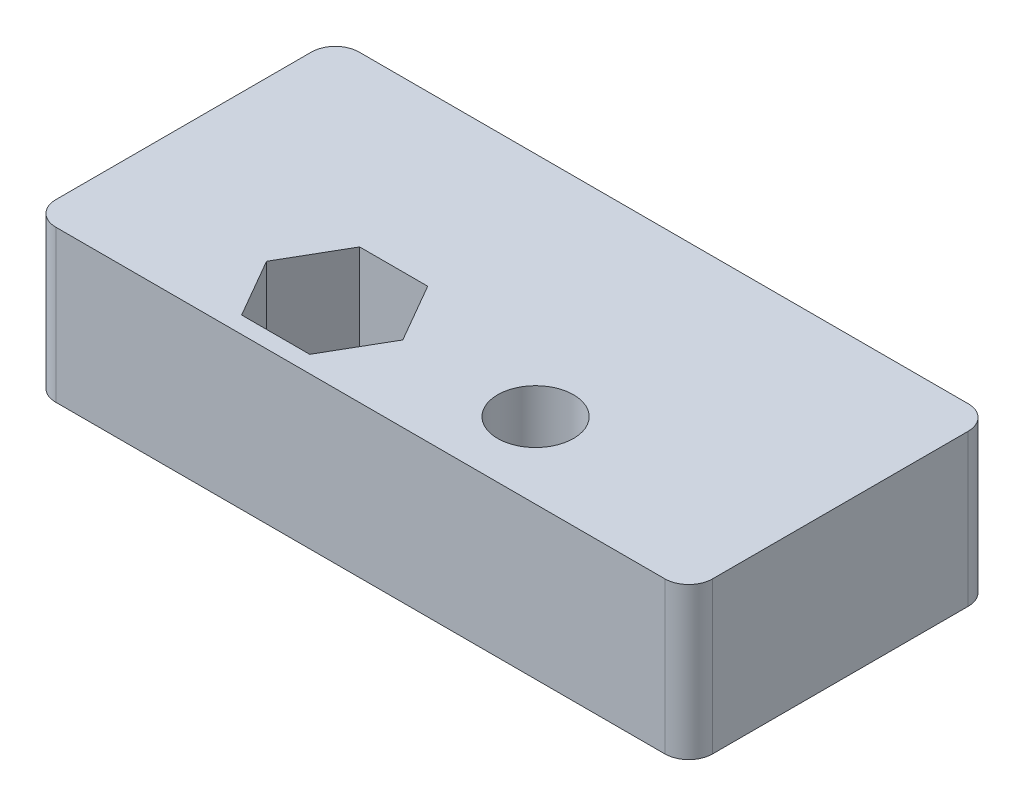
ISO-10303-21;
HEADER;
FILE_DESCRIPTION(('STEP AP214'),'2;1');
FILE_NAME('part.step','',(''),(''),'','','');
FILE_SCHEMA(('AUTOMOTIVE_DESIGN { 1 0 10303 214 1 1 1 1 }'));
ENDSEC;
DATA;
#1=APPLICATION_CONTEXT('core data for automotive mechanical design processes');
#2=APPLICATION_PROTOCOL_DEFINITION('international standard','automotive_design',2000,#1);
#3=PRODUCT_CONTEXT('',#1,'mechanical');
#4=PRODUCT('Part','Part','',(#3));
#5=PRODUCT_RELATED_PRODUCT_CATEGORY('part','',(#4));
#6=PRODUCT_DEFINITION_FORMATION('','',#4);
#7=PRODUCT_DEFINITION_CONTEXT('part definition',#1,'design');
#8=PRODUCT_DEFINITION('design','',#6,#7);
#9=PRODUCT_DEFINITION_SHAPE('','',#8);
#10=(LENGTH_UNIT() NAMED_UNIT(*) SI_UNIT(.MILLI.,.METRE.));
#11=(NAMED_UNIT(*) PLANE_ANGLE_UNIT() SI_UNIT($,.RADIAN.));
#12=(NAMED_UNIT(*) SI_UNIT($,.STERADIAN.) SOLID_ANGLE_UNIT());
#13=UNCERTAINTY_MEASURE_WITH_UNIT(LENGTH_MEASURE(1.E-05),#10,'distance_accuracy_value','');
#14=(GEOMETRIC_REPRESENTATION_CONTEXT(3) GLOBAL_UNCERTAINTY_ASSIGNED_CONTEXT((#13)) GLOBAL_UNIT_ASSIGNED_CONTEXT((#10,
#11,#12)) REPRESENTATION_CONTEXT('',''));
#15=CARTESIAN_POINT('',(0.,0.,0.));
#16=DIRECTION('',(0.,0.,1.));
#17=DIRECTION('',(1.,0.,0.));
#18=AXIS2_PLACEMENT_3D('',#15,#16,#17);
#19=CARTESIAN_POINT('',(0.,6.35,0.));
#20=DIRECTION('',(0.,-1.,0.));
#21=DIRECTION('',(0.,0.,-1.));
#22=AXIS2_PLACEMENT_3D('',#19,#20,#21);
#23=PLANE('',#22);
#24=CARTESIAN_POINT('',(17.9125,6.35,-3.175));
#25=DIRECTION('',(0.,1.,0.));
#26=DIRECTION('',(0.,0.,1.));
#27=AXIS2_PLACEMENT_3D('',#24,#25,#26);
#28=CIRCLE('',#27,1.5875);
#29=CARTESIAN_POINT('',(17.9125,6.35,-1.5875));
#30=VERTEX_POINT('',#29);
#31=EDGE_CURVE('E191',#30,#30,#28,.T.);
#32=ORIENTED_EDGE('',*,*,#31,.F.);
#33=EDGE_LOOP('',(#32));
#34=FACE_BOUND('',#33,.T.);
#35=DIRECTION('',(0.,0.,1.));
#36=VECTOR('',#35,1.);
#37=CARTESIAN_POINT('',(0.,6.35,0.));
#38=LINE('',#37,#36);
#39=CARTESIAN_POINT('',(0.,6.35,-11.7));
#40=VERTEX_POINT('',#39);
#41=CARTESIAN_POINT('',(0.,6.35,-1.));
#42=VERTEX_POINT('',#41);
#43=EDGE_CURVE('E197',#40,#42,#38,.T.);
#44=ORIENTED_EDGE('',*,*,#43,.T.);
#45=CARTESIAN_POINT('',(1.,6.35,-1.));
#46=DIRECTION('',(0.,-1.,0.));
#47=DIRECTION('',(0.,0.,-1.));
#48=AXIS2_PLACEMENT_3D('',#45,#46,#47);
#49=CIRCLE('',#48,1.);
#50=CARTESIAN_POINT('',(1.,6.35,0.));
#51=VERTEX_POINT('',#50);
#52=EDGE_CURVE('E240',#42,#51,#49,.F.);
#53=ORIENTED_EDGE('',*,*,#52,.T.);
#54=DIRECTION('',(1.,0.,0.));
#55=VECTOR('',#54,1.);
#56=CARTESIAN_POINT('',(0.,6.35,0.));
#57=LINE('',#56,#55);
#58=CARTESIAN_POINT('',(26.5,6.35,0.));
#59=VERTEX_POINT('',#58);
#60=EDGE_CURVE('E200',#51,#59,#57,.T.);
#61=ORIENTED_EDGE('',*,*,#60,.T.);
#62=CARTESIAN_POINT('',(26.5,6.35,-1.));
#63=DIRECTION('',(0.,-1.,0.));
#64=DIRECTION('',(0.,0.,-1.));
#65=AXIS2_PLACEMENT_3D('',#62,#63,#64);
#66=CIRCLE('',#65,1.);
#67=CARTESIAN_POINT('',(27.5,6.35,-1.));
#68=VERTEX_POINT('',#67);
#69=EDGE_CURVE('E235',#59,#68,#66,.F.);
#70=ORIENTED_EDGE('',*,*,#69,.T.);
#71=DIRECTION('',(0.,0.,-1.));
#72=VECTOR('',#71,1.);
#73=CARTESIAN_POINT('',(27.5,6.35,0.));
#74=LINE('',#73,#72);
#75=CARTESIAN_POINT('',(27.5,6.35,-11.7));
#76=VERTEX_POINT('',#75);
#77=EDGE_CURVE('E204',#68,#76,#74,.T.);
#78=ORIENTED_EDGE('',*,*,#77,.T.);
#79=CARTESIAN_POINT('',(26.5,6.35,-11.7));
#80=DIRECTION('',(0.,-1.,0.));
#81=DIRECTION('',(0.,0.,-1.));
#82=AXIS2_PLACEMENT_3D('',#79,#80,#81);
#83=CIRCLE('',#82,1.);
#84=CARTESIAN_POINT('',(26.5,6.35,-12.7));
#85=VERTEX_POINT('',#84);
#86=EDGE_CURVE('E54',#76,#85,#83,.F.);
#87=ORIENTED_EDGE('',*,*,#86,.T.);
#88=DIRECTION('',(-1.,0.,0.));
#89=VECTOR('',#88,1.);
#90=CARTESIAN_POINT('',(0.,6.35,-12.7));
#91=LINE('',#90,#89);
#92=CARTESIAN_POINT('',(1.,6.35,-12.7));
#93=VERTEX_POINT('',#92);
#94=EDGE_CURVE('E206',#85,#93,#91,.T.);
#95=ORIENTED_EDGE('',*,*,#94,.T.);
#96=CARTESIAN_POINT('',(1.,6.35,-11.7));
#97=DIRECTION('',(0.,-1.,0.));
#98=DIRECTION('',(0.,0.,-1.));
#99=AXIS2_PLACEMENT_3D('',#96,#97,#98);
#100=CIRCLE('',#99,1.);
#101=EDGE_CURVE('E238',#93,#40,#100,.F.);
#102=ORIENTED_EDGE('',*,*,#101,.T.);
#103=EDGE_LOOP('',(#44,#53,#61,#70,#78,#87,#95,#102));
#104=FACE_BOUND('',#103,.T.);
#105=DIRECTION('',(0.5,0.,-0.866025403784439));
#106=VECTOR('',#105,1.);
#107=CARTESIAN_POINT('',(10.9261417674388,6.35,-0.70485));
#108=LINE('',#107,#106);
#109=CARTESIAN_POINT('',(10.9261417674388,6.35,-0.70485));
#110=VERTEX_POINT('',#109);
#111=CARTESIAN_POINT('',(12.3522835348775,6.35,-3.175));
#112=VERTEX_POINT('',#111);
#113=EDGE_CURVE('E135',#110,#112,#108,.T.);
#114=ORIENTED_EDGE('',*,*,#113,.F.);
#115=DIRECTION('',(1.,0.,0.));
#116=VECTOR('',#115,1.);
#117=CARTESIAN_POINT('',(8.07385823256124,6.35,-0.704850000000001));
#118=LINE('',#117,#116);
#119=CARTESIAN_POINT('',(8.07385823256124,6.35,-0.704850000000001));
#120=VERTEX_POINT('',#119);
#121=EDGE_CURVE('E167',#120,#110,#118,.T.);
#122=ORIENTED_EDGE('',*,*,#121,.F.);
#123=DIRECTION('',(0.5,0.,0.866025403784439));
#124=VECTOR('',#123,1.);
#125=CARTESIAN_POINT('',(6.64771646512249,6.35,-3.175));
#126=LINE('',#125,#124);
#127=CARTESIAN_POINT('',(6.64771646512249,6.35,-3.175));
#128=VERTEX_POINT('',#127);
#129=EDGE_CURVE('E164',#128,#120,#126,.T.);
#130=ORIENTED_EDGE('',*,*,#129,.F.);
#131=DIRECTION('',(-0.5,0.,0.866025403784439));
#132=VECTOR('',#131,1.);
#133=CARTESIAN_POINT('',(8.07385823256125,6.35,-5.64515));
#134=LINE('',#133,#132);
#135=CARTESIAN_POINT('',(8.07385823256125,6.35,-5.64515));
#136=VERTEX_POINT('',#135);
#137=EDGE_CURVE('E160',#136,#128,#134,.T.);
#138=ORIENTED_EDGE('',*,*,#137,.F.);
#139=DIRECTION('',(-1.,0.,0.));
#140=VECTOR('',#139,1.);
#141=CARTESIAN_POINT('',(10.9261417674388,6.35,-5.64515));
#142=LINE('',#141,#140);
#143=CARTESIAN_POINT('',(10.9261417674388,6.35,-5.64515));
#144=VERTEX_POINT('',#143);
#145=EDGE_CURVE('E158',#144,#136,#142,.T.);
#146=ORIENTED_EDGE('',*,*,#145,.F.);
#147=DIRECTION('',(-0.5,0.,-0.866025403784439));
#148=VECTOR('',#147,1.);
#149=CARTESIAN_POINT('',(12.3522835348775,6.35,-3.175));
#150=LINE('',#149,#148);
#151=EDGE_CURVE('E145',#112,#144,#150,.T.);
#152=ORIENTED_EDGE('',*,*,#151,.F.);
#153=EDGE_LOOP('',(#114,#122,#130,#138,#146,#152));
#154=FACE_BOUND('',#153,.T.);
#155=ADVANCED_FACE('F32',(#34,#104,#154),#23,.F.);
#156=CARTESIAN_POINT('',(0.,0.,0.));
#157=DIRECTION('',(0.,-1.,0.));
#158=DIRECTION('',(0.,0.,-1.));
#159=AXIS2_PLACEMENT_3D('',#156,#157,#158);
#160=PLANE('',#159);
#161=DIRECTION('',(1.,0.,0.));
#162=VECTOR('',#161,1.);
#163=CARTESIAN_POINT('',(0.,0.,0.));
#164=LINE('',#163,#162);
#165=CARTESIAN_POINT('',(1.,0.,0.));
#166=VERTEX_POINT('',#165);
#167=CARTESIAN_POINT('',(26.5,0.,0.));
#168=VERTEX_POINT('',#167);
#169=EDGE_CURVE('E211',#166,#168,#164,.T.);
#170=ORIENTED_EDGE('',*,*,#169,.F.);
#171=CARTESIAN_POINT('',(1.,0.,-1.));
#172=DIRECTION('',(0.,-1.,0.));
#173=DIRECTION('',(0.,0.,-1.));
#174=AXIS2_PLACEMENT_3D('',#171,#172,#173);
#175=CIRCLE('',#174,1.);
#176=CARTESIAN_POINT('',(0.,0.,-1.));
#177=VERTEX_POINT('',#176);
#178=EDGE_CURVE('E228',#166,#177,#175,.T.);
#179=ORIENTED_EDGE('',*,*,#178,.T.);
#180=DIRECTION('',(0.,0.,1.));
#181=VECTOR('',#180,1.);
#182=CARTESIAN_POINT('',(0.,0.,0.));
#183=LINE('',#182,#181);
#184=CARTESIAN_POINT('',(0.,0.,-11.7));
#185=VERTEX_POINT('',#184);
#186=EDGE_CURVE('E194',#185,#177,#183,.T.);
#187=ORIENTED_EDGE('',*,*,#186,.F.);
#188=CARTESIAN_POINT('',(1.,0.,-11.7));
#189=DIRECTION('',(0.,-1.,0.));
#190=DIRECTION('',(0.,0.,-1.));
#191=AXIS2_PLACEMENT_3D('',#188,#189,#190);
#192=CIRCLE('',#191,1.);
#193=CARTESIAN_POINT('',(1.,0.,-12.7));
#194=VERTEX_POINT('',#193);
#195=EDGE_CURVE('E226',#185,#194,#192,.T.);
#196=ORIENTED_EDGE('',*,*,#195,.T.);
#197=DIRECTION('',(-1.,0.,0.));
#198=VECTOR('',#197,1.);
#199=CARTESIAN_POINT('',(0.,0.,-12.7));
#200=LINE('',#199,#198);
#201=CARTESIAN_POINT('',(26.5,0.,-12.7));
#202=VERTEX_POINT('',#201);
#203=EDGE_CURVE('E201',#202,#194,#200,.T.);
#204=ORIENTED_EDGE('',*,*,#203,.F.);
#205=CARTESIAN_POINT('',(26.5,0.,-11.7));
#206=DIRECTION('',(0.,-1.,0.));
#207=DIRECTION('',(0.,0.,-1.));
#208=AXIS2_PLACEMENT_3D('',#205,#206,#207);
#209=CIRCLE('',#208,1.);
#210=CARTESIAN_POINT('',(27.5,0.,-11.7));
#211=VERTEX_POINT('',#210);
#212=EDGE_CURVE('E224',#202,#211,#209,.T.);
#213=ORIENTED_EDGE('',*,*,#212,.T.);
#214=DIRECTION('',(0.,0.,-1.));
#215=VECTOR('',#214,1.);
#216=CARTESIAN_POINT('',(27.5,0.,0.));
#217=LINE('',#216,#215);
#218=CARTESIAN_POINT('',(27.5,0.,-1.));
#219=VERTEX_POINT('',#218);
#220=EDGE_CURVE('E214',#219,#211,#217,.T.);
#221=ORIENTED_EDGE('',*,*,#220,.F.);
#222=CARTESIAN_POINT('',(26.5,0.,-1.));
#223=DIRECTION('',(0.,-1.,0.));
#224=DIRECTION('',(0.,0.,-1.));
#225=AXIS2_PLACEMENT_3D('',#222,#223,#224);
#226=CIRCLE('',#225,1.);
#227=EDGE_CURVE('E222',#219,#168,#226,.T.);
#228=ORIENTED_EDGE('',*,*,#227,.T.);
#229=EDGE_LOOP('',(#170,#179,#187,#196,#204,#213,#221,#228));
#230=FACE_BOUND('',#229,.T.);
#231=CARTESIAN_POINT('',(17.9125,0.,-3.175));
#232=DIRECTION('',(0.,1.,0.));
#233=DIRECTION('',(0.,0.,1.));
#234=AXIS2_PLACEMENT_3D('',#231,#232,#233);
#235=CIRCLE('',#234,1.5875);
#236=CARTESIAN_POINT('',(17.9125,0.,-1.5875));
#237=VERTEX_POINT('',#236);
#238=EDGE_CURVE('E153',#237,#237,#235,.T.);
#239=ORIENTED_EDGE('',*,*,#238,.T.);
#240=EDGE_LOOP('',(#239));
#241=FACE_BOUND('',#240,.T.);
#242=DIRECTION('',(1.,0.,0.));
#243=VECTOR('',#242,1.);
#244=CARTESIAN_POINT('',(8.07385823256124,0.,-0.704850000000001));
#245=LINE('',#244,#243);
#246=CARTESIAN_POINT('',(8.07385823256124,0.,-0.704850000000001));
#247=VERTEX_POINT('',#246);
#248=CARTESIAN_POINT('',(10.9261417674388,0.,-0.70485));
#249=VERTEX_POINT('',#248);
#250=EDGE_CURVE('E146',#247,#249,#245,.T.);
#251=ORIENTED_EDGE('',*,*,#250,.T.);
#252=DIRECTION('',(0.5,0.,-0.866025403784439));
#253=VECTOR('',#252,1.);
#254=CARTESIAN_POINT('',(10.9261417674388,0.,-0.70485));
#255=LINE('',#254,#253);
#256=CARTESIAN_POINT('',(12.3522835348775,0.,-3.175));
#257=VERTEX_POINT('',#256);
#258=EDGE_CURVE('E169',#249,#257,#255,.T.);
#259=ORIENTED_EDGE('',*,*,#258,.T.);
#260=DIRECTION('',(-0.5,0.,-0.866025403784439));
#261=VECTOR('',#260,1.);
#262=CARTESIAN_POINT('',(12.3522835348775,0.,-3.175));
#263=LINE('',#262,#261);
#264=CARTESIAN_POINT('',(10.9261417674388,0.,-5.64515));
#265=VERTEX_POINT('',#264);
#266=EDGE_CURVE('E152',#257,#265,#263,.T.);
#267=ORIENTED_EDGE('',*,*,#266,.T.);
#268=DIRECTION('',(-1.,0.,0.));
#269=VECTOR('',#268,1.);
#270=CARTESIAN_POINT('',(10.9261417674388,0.,-5.64515));
#271=LINE('',#270,#269);
#272=CARTESIAN_POINT('',(8.07385823256125,0.,-5.64515));
#273=VERTEX_POINT('',#272);
#274=EDGE_CURVE('E172',#265,#273,#271,.T.);
#275=ORIENTED_EDGE('',*,*,#274,.T.);
#276=DIRECTION('',(-0.5,0.,0.866025403784439));
#277=VECTOR('',#276,1.);
#278=CARTESIAN_POINT('',(8.07385823256125,0.,-5.64515));
#279=LINE('',#278,#277);
#280=CARTESIAN_POINT('',(6.64771646512249,0.,-3.175));
#281=VERTEX_POINT('',#280);
#282=EDGE_CURVE('E175',#273,#281,#279,.T.);
#283=ORIENTED_EDGE('',*,*,#282,.T.);
#284=DIRECTION('',(0.5,0.,0.866025403784439));
#285=VECTOR('',#284,1.);
#286=CARTESIAN_POINT('',(6.64771646512249,0.,-3.175));
#287=LINE('',#286,#285);
#288=EDGE_CURVE('E178',#281,#247,#287,.T.);
#289=ORIENTED_EDGE('',*,*,#288,.T.);
#290=EDGE_LOOP('',(#251,#259,#267,#275,#283,#289));
#291=FACE_BOUND('',#290,.T.);
#292=ADVANCED_FACE('F256',(#230,#241,#291),#160,.T.);
#293=CARTESIAN_POINT('',(0.,6.35,0.));
#294=DIRECTION('',(1.,0.,0.));
#295=DIRECTION('',(0.,0.,-1.));
#296=AXIS2_PLACEMENT_3D('',#293,#294,#295);
#297=PLANE('',#296);
#298=ORIENTED_EDGE('',*,*,#186,.T.);
#299=DIRECTION('',(0.,-1.,0.));
#300=VECTOR('',#299,1.);
#301=CARTESIAN_POINT('',(0.,6.35,-1.));
#302=LINE('',#301,#300);
#303=EDGE_CURVE('E233',#177,#42,#302,.F.);
#304=ORIENTED_EDGE('',*,*,#303,.T.);
#305=ORIENTED_EDGE('',*,*,#43,.F.);
#306=DIRECTION('',(0.,-1.,0.));
#307=VECTOR('',#306,1.);
#308=CARTESIAN_POINT('',(0.,6.35,-11.7));
#309=LINE('',#308,#307);
#310=EDGE_CURVE('E230',#40,#185,#309,.T.);
#311=ORIENTED_EDGE('',*,*,#310,.T.);
#312=EDGE_LOOP('',(#298,#304,#305,#311));
#313=FACE_BOUND('',#312,.T.);
#314=ADVANCED_FACE('F270',(#313),#297,.F.);
#315=CARTESIAN_POINT('',(0.,6.35,0.));
#316=DIRECTION('',(0.,0.,-1.));
#317=DIRECTION('',(-1.,0.,0.));
#318=AXIS2_PLACEMENT_3D('',#315,#316,#317);
#319=PLANE('',#318);
#320=ORIENTED_EDGE('',*,*,#60,.F.);
#321=DIRECTION('',(0.,-1.,0.));
#322=VECTOR('',#321,1.);
#323=CARTESIAN_POINT('',(1.,6.35,0.));
#324=LINE('',#323,#322);
#325=EDGE_CURVE('E219',#51,#166,#324,.T.);
#326=ORIENTED_EDGE('',*,*,#325,.T.);
#327=ORIENTED_EDGE('',*,*,#169,.T.);
#328=DIRECTION('',(0.,-1.,0.));
#329=VECTOR('',#328,1.);
#330=CARTESIAN_POINT('',(26.5,6.35,0.));
#331=LINE('',#330,#329);
#332=EDGE_CURVE('E208',#168,#59,#331,.F.);
#333=ORIENTED_EDGE('',*,*,#332,.T.);
#334=EDGE_LOOP('',(#320,#326,#327,#333));
#335=FACE_BOUND('',#334,.T.);
#336=ADVANCED_FACE('F278',(#335),#319,.F.);
#337=CARTESIAN_POINT('',(27.5,6.35,0.));
#338=DIRECTION('',(-1.,0.,0.));
#339=DIRECTION('',(0.,0.,1.));
#340=AXIS2_PLACEMENT_3D('',#337,#338,#339);
#341=PLANE('',#340);
#342=ORIENTED_EDGE('',*,*,#220,.T.);
#343=DIRECTION('',(0.,-1.,0.));
#344=VECTOR('',#343,1.);
#345=CARTESIAN_POINT('',(27.5,6.35,-11.7));
#346=LINE('',#345,#344);
#347=EDGE_CURVE('E11',#211,#76,#346,.F.);
#348=ORIENTED_EDGE('',*,*,#347,.T.);
#349=ORIENTED_EDGE('',*,*,#77,.F.);
#350=DIRECTION('',(0.,-1.,0.));
#351=VECTOR('',#350,1.);
#352=CARTESIAN_POINT('',(27.5,6.35,-1.));
#353=LINE('',#352,#351);
#354=EDGE_CURVE('E40',#68,#219,#353,.T.);
#355=ORIENTED_EDGE('',*,*,#354,.T.);
#356=EDGE_LOOP('',(#342,#348,#349,#355));
#357=FACE_BOUND('',#356,.T.);
#358=ADVANCED_FACE('F250',(#357),#341,.F.);
#359=CARTESIAN_POINT('',(0.,6.35,-12.7));
#360=DIRECTION('',(0.,0.,1.));
#361=DIRECTION('',(1.,0.,0.));
#362=AXIS2_PLACEMENT_3D('',#359,#360,#361);
#363=PLANE('',#362);
#364=ORIENTED_EDGE('',*,*,#203,.T.);
#365=DIRECTION('',(0.,-1.,0.));
#366=VECTOR('',#365,1.);
#367=CARTESIAN_POINT('',(1.,6.35,-12.7));
#368=LINE('',#367,#366);
#369=EDGE_CURVE('E47',#194,#93,#368,.F.);
#370=ORIENTED_EDGE('',*,*,#369,.T.);
#371=ORIENTED_EDGE('',*,*,#94,.F.);
#372=DIRECTION('',(0.,-1.,0.));
#373=VECTOR('',#372,1.);
#374=CARTESIAN_POINT('',(26.5,6.35,-12.7));
#375=LINE('',#374,#373);
#376=EDGE_CURVE('E242',#85,#202,#375,.T.);
#377=ORIENTED_EDGE('',*,*,#376,.T.);
#378=EDGE_LOOP('',(#364,#370,#371,#377));
#379=FACE_BOUND('',#378,.T.);
#380=ADVANCED_FACE('F262',(#379),#363,.F.);
#381=CARTESIAN_POINT('',(17.9125,6.35,-3.175));
#382=DIRECTION('',(0.,-1.,0.));
#383=DIRECTION('',(0.,0.,-1.));
#384=AXIS2_PLACEMENT_3D('',#381,#382,#383);
#385=CYLINDRICAL_SURFACE('',#384,1.5875);
#386=ORIENTED_EDGE('',*,*,#31,.T.);
#387=EDGE_LOOP('',(#386));
#388=FACE_BOUND('',#387,.T.);
#389=ORIENTED_EDGE('',*,*,#238,.F.);
#390=EDGE_LOOP('',(#389));
#391=FACE_BOUND('',#390,.T.);
#392=ADVANCED_FACE('F293',(#388,#391),#385,.F.);
#393=CARTESIAN_POINT('',(10.9261417674388,6.35,-0.70485));
#394=DIRECTION('',(-0.866025403784439,0.,-0.5));
#395=DIRECTION('',(-0.5,0.,0.866025403784439));
#396=AXIS2_PLACEMENT_3D('',#393,#394,#395);
#397=PLANE('',#396);
#398=ORIENTED_EDGE('',*,*,#258,.F.);
#399=DIRECTION('',(0.,-1.,0.));
#400=VECTOR('',#399,1.);
#401=CARTESIAN_POINT('',(10.9261417674388,6.35,-0.70485));
#402=LINE('',#401,#400);
#403=EDGE_CURVE('E141',#110,#249,#402,.T.);
#404=ORIENTED_EDGE('',*,*,#403,.F.);
#405=ORIENTED_EDGE('',*,*,#113,.T.);
#406=DIRECTION('',(0.,-1.,0.));
#407=VECTOR('',#406,1.);
#408=CARTESIAN_POINT('',(12.3522835348775,6.35,-3.175));
#409=LINE('',#408,#407);
#410=EDGE_CURVE('E138',#112,#257,#409,.T.);
#411=ORIENTED_EDGE('',*,*,#410,.T.);
#412=EDGE_LOOP('',(#398,#404,#405,#411));
#413=FACE_BOUND('',#412,.T.);
#414=ADVANCED_FACE('F137',(#413),#397,.T.);
#415=CARTESIAN_POINT('',(12.3522835348775,6.35,-3.175));
#416=DIRECTION('',(-0.866025403784439,0.,0.5));
#417=DIRECTION('',(0.5,0.,0.866025403784439));
#418=AXIS2_PLACEMENT_3D('',#415,#416,#417);
#419=PLANE('',#418);
#420=ORIENTED_EDGE('',*,*,#266,.F.);
#421=ORIENTED_EDGE('',*,*,#410,.F.);
#422=ORIENTED_EDGE('',*,*,#151,.T.);
#423=DIRECTION('',(0.,-1.,0.));
#424=VECTOR('',#423,1.);
#425=CARTESIAN_POINT('',(10.9261417674388,6.35,-5.64515));
#426=LINE('',#425,#424);
#427=EDGE_CURVE('E154',#144,#265,#426,.T.);
#428=ORIENTED_EDGE('',*,*,#427,.T.);
#429=EDGE_LOOP('',(#420,#421,#422,#428));
#430=FACE_BOUND('',#429,.T.);
#431=ADVANCED_FACE('F149',(#430),#419,.T.);
#432=CARTESIAN_POINT('',(10.9261417674388,6.35,-5.64515));
#433=DIRECTION('',(0.,0.,1.));
#434=DIRECTION('',(1.,0.,0.));
#435=AXIS2_PLACEMENT_3D('',#432,#433,#434);
#436=PLANE('',#435);
#437=ORIENTED_EDGE('',*,*,#274,.F.);
#438=ORIENTED_EDGE('',*,*,#427,.F.);
#439=ORIENTED_EDGE('',*,*,#145,.T.);
#440=DIRECTION('',(0.,-1.,0.));
#441=VECTOR('',#440,1.);
#442=CARTESIAN_POINT('',(8.07385823256125,6.35,-5.64515));
#443=LINE('',#442,#441);
#444=EDGE_CURVE('E188',#136,#273,#443,.T.);
#445=ORIENTED_EDGE('',*,*,#444,.T.);
#446=EDGE_LOOP('',(#437,#438,#439,#445));
#447=FACE_BOUND('',#446,.T.);
#448=ADVANCED_FACE('F355',(#447),#436,.T.);
#449=CARTESIAN_POINT('',(8.07385823256125,6.35,-5.64515));
#450=DIRECTION('',(0.866025403784439,0.,0.5));
#451=DIRECTION('',(0.5,0.,-0.866025403784439));
#452=AXIS2_PLACEMENT_3D('',#449,#450,#451);
#453=PLANE('',#452);
#454=ORIENTED_EDGE('',*,*,#282,.F.);
#455=ORIENTED_EDGE('',*,*,#444,.F.);
#456=ORIENTED_EDGE('',*,*,#137,.T.);
#457=DIRECTION('',(0.,-1.,0.));
#458=VECTOR('',#457,1.);
#459=CARTESIAN_POINT('',(6.64771646512249,6.35,-3.175));
#460=LINE('',#459,#458);
#461=EDGE_CURVE('E186',#128,#281,#460,.T.);
#462=ORIENTED_EDGE('',*,*,#461,.T.);
#463=EDGE_LOOP('',(#454,#455,#456,#462));
#464=FACE_BOUND('',#463,.T.);
#465=ADVANCED_FACE('F346',(#464),#453,.T.);
#466=CARTESIAN_POINT('',(6.64771646512249,6.35,-3.175));
#467=DIRECTION('',(0.866025403784439,0.,-0.5));
#468=DIRECTION('',(-0.5,0.,-0.866025403784439));
#469=AXIS2_PLACEMENT_3D('',#466,#467,#468);
#470=PLANE('',#469);
#471=ORIENTED_EDGE('',*,*,#288,.F.);
#472=ORIENTED_EDGE('',*,*,#461,.F.);
#473=ORIENTED_EDGE('',*,*,#129,.T.);
#474=DIRECTION('',(0.,-1.,0.));
#475=VECTOR('',#474,1.);
#476=CARTESIAN_POINT('',(8.07385823256124,6.35,-0.704850000000001));
#477=LINE('',#476,#475);
#478=EDGE_CURVE('E184',#120,#247,#477,.T.);
#479=ORIENTED_EDGE('',*,*,#478,.T.);
#480=EDGE_LOOP('',(#471,#472,#473,#479));
#481=FACE_BOUND('',#480,.T.);
#482=ADVANCED_FACE('F337',(#481),#470,.T.);
#483=CARTESIAN_POINT('',(8.07385823256124,6.35,-0.704850000000001));
#484=DIRECTION('',(0.,0.,-1.));
#485=DIRECTION('',(-1.,0.,0.));
#486=AXIS2_PLACEMENT_3D('',#483,#484,#485);
#487=PLANE('',#486);
#488=ORIENTED_EDGE('',*,*,#250,.F.);
#489=ORIENTED_EDGE('',*,*,#478,.F.);
#490=ORIENTED_EDGE('',*,*,#121,.T.);
#491=ORIENTED_EDGE('',*,*,#403,.T.);
#492=EDGE_LOOP('',(#488,#489,#490,#491));
#493=FACE_BOUND('',#492,.T.);
#494=ADVANCED_FACE('F306',(#493),#487,.T.);
#495=CARTESIAN_POINT('',(1.,6.35,-1.));
#496=DIRECTION('',(0.,-1.,0.));
#497=DIRECTION('',(0.,0.,-1.));
#498=AXIS2_PLACEMENT_3D('',#495,#496,#497);
#499=CYLINDRICAL_SURFACE('',#498,1.);
#500=ORIENTED_EDGE('',*,*,#52,.F.);
#501=ORIENTED_EDGE('',*,*,#303,.F.);
#502=ORIENTED_EDGE('',*,*,#178,.F.);
#503=ORIENTED_EDGE('',*,*,#325,.F.);
#504=EDGE_LOOP('',(#500,#501,#502,#503));
#505=FACE_BOUND('',#504,.T.);
#506=ADVANCED_FACE('F275',(#505),#499,.T.);
#507=CARTESIAN_POINT('',(1.,6.35,-11.7));
#508=DIRECTION('',(0.,-1.,0.));
#509=DIRECTION('',(0.,0.,-1.));
#510=AXIS2_PLACEMENT_3D('',#507,#508,#509);
#511=CYLINDRICAL_SURFACE('',#510,1.);
#512=ORIENTED_EDGE('',*,*,#101,.F.);
#513=ORIENTED_EDGE('',*,*,#369,.F.);
#514=ORIENTED_EDGE('',*,*,#195,.F.);
#515=ORIENTED_EDGE('',*,*,#310,.F.);
#516=EDGE_LOOP('',(#512,#513,#514,#515));
#517=FACE_BOUND('',#516,.T.);
#518=ADVANCED_FACE('F267',(#517),#511,.T.);
#519=CARTESIAN_POINT('',(26.5,6.35,-11.7));
#520=DIRECTION('',(0.,-1.,0.));
#521=DIRECTION('',(0.,0.,-1.));
#522=AXIS2_PLACEMENT_3D('',#519,#520,#521);
#523=CYLINDRICAL_SURFACE('',#522,1.);
#524=ORIENTED_EDGE('',*,*,#86,.F.);
#525=ORIENTED_EDGE('',*,*,#347,.F.);
#526=ORIENTED_EDGE('',*,*,#212,.F.);
#527=ORIENTED_EDGE('',*,*,#376,.F.);
#528=EDGE_LOOP('',(#524,#525,#526,#527));
#529=FACE_BOUND('',#528,.T.);
#530=ADVANCED_FACE('F261',(#529),#523,.T.);
#531=CARTESIAN_POINT('',(26.5,6.35,-1.));
#532=DIRECTION('',(0.,-1.,0.));
#533=DIRECTION('',(0.,0.,-1.));
#534=AXIS2_PLACEMENT_3D('',#531,#532,#533);
#535=CYLINDRICAL_SURFACE('',#534,1.);
#536=ORIENTED_EDGE('',*,*,#69,.F.);
#537=ORIENTED_EDGE('',*,*,#332,.F.);
#538=ORIENTED_EDGE('',*,*,#227,.F.);
#539=ORIENTED_EDGE('',*,*,#354,.F.);
#540=EDGE_LOOP('',(#536,#537,#538,#539));
#541=FACE_BOUND('',#540,.T.);
#542=ADVANCED_FACE('F34',(#541),#535,.T.);
#543=CLOSED_SHELL('',(#155,#292,#314,#336,#358,#380,#392,#414,#431,#448,#465,#482,#494,#506,
#518,#530,#542));
#544=MANIFOLD_SOLID_BREP('B2',#543);
#545=ADVANCED_BREP_SHAPE_REPRESENTATION('',(#18,#544),#14);
#546=SHAPE_DEFINITION_REPRESENTATION(#9,#545);
ENDSEC;
END-ISO-10303-21;
